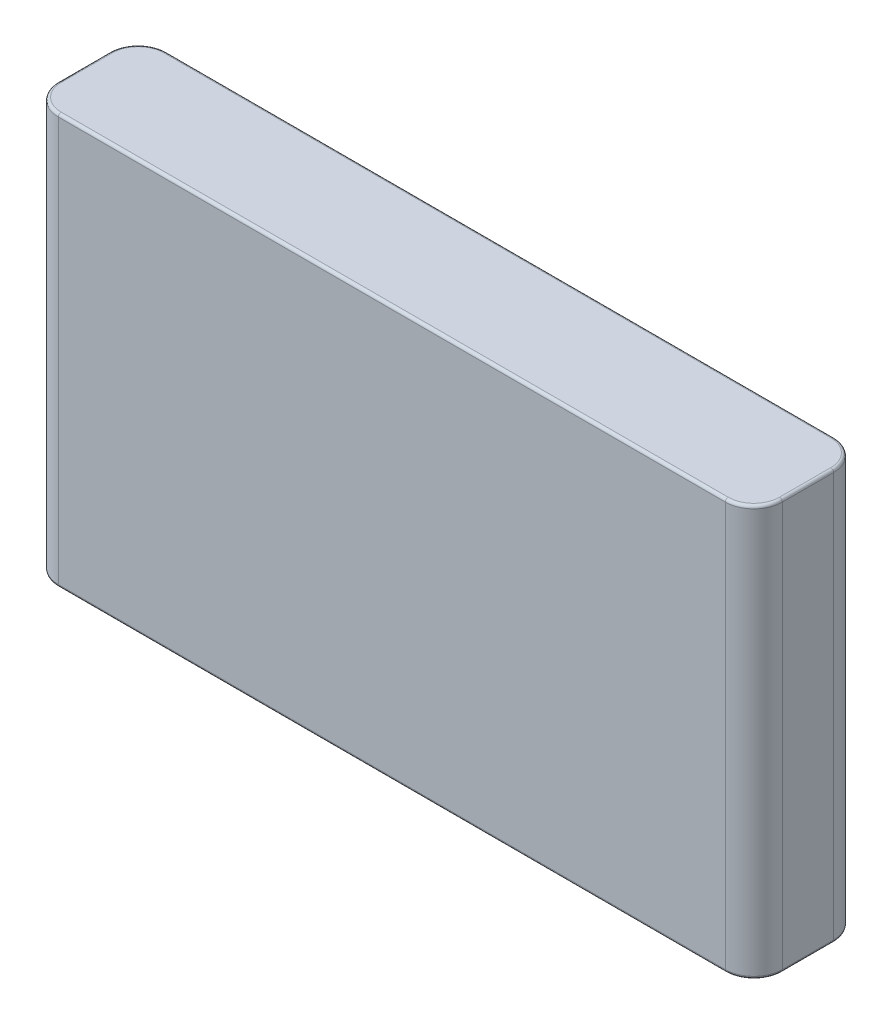
ISO-10303-21;
HEADER;
FILE_DESCRIPTION(('STEP AP214'),'2;1');
FILE_NAME('part.step','',(''),(''),'','','');
FILE_SCHEMA(('AUTOMOTIVE_DESIGN { 1 0 10303 214 1 1 1 1 }'));
ENDSEC;
DATA;
#1=APPLICATION_CONTEXT('core data for automotive mechanical design processes');
#2=APPLICATION_PROTOCOL_DEFINITION('international standard','automotive_design',2000,#1);
#3=PRODUCT_CONTEXT('',#1,'mechanical');
#4=PRODUCT('Part','Part','',(#3));
#5=PRODUCT_RELATED_PRODUCT_CATEGORY('part','',(#4));
#6=PRODUCT_DEFINITION_FORMATION('','',#4);
#7=PRODUCT_DEFINITION_CONTEXT('part definition',#1,'design');
#8=PRODUCT_DEFINITION('design','',#6,#7);
#9=PRODUCT_DEFINITION_SHAPE('','',#8);
#10=(LENGTH_UNIT() NAMED_UNIT(*) SI_UNIT(.MILLI.,.METRE.));
#11=(NAMED_UNIT(*) PLANE_ANGLE_UNIT() SI_UNIT($,.RADIAN.));
#12=(NAMED_UNIT(*) SI_UNIT($,.STERADIAN.) SOLID_ANGLE_UNIT());
#13=UNCERTAINTY_MEASURE_WITH_UNIT(LENGTH_MEASURE(1.E-05),#10,'distance_accuracy_value','');
#14=(GEOMETRIC_REPRESENTATION_CONTEXT(3) GLOBAL_UNCERTAINTY_ASSIGNED_CONTEXT((#13)) GLOBAL_UNIT_ASSIGNED_CONTEXT((#10,
#11,#12)) REPRESENTATION_CONTEXT('',''));
#15=CARTESIAN_POINT('',(0.,0.,0.));
#16=DIRECTION('',(0.,0.,1.));
#17=DIRECTION('',(1.,0.,0.));
#18=AXIS2_PLACEMENT_3D('',#15,#16,#17);
#19=CARTESIAN_POINT('',(63.5,-36.,19.));
#20=DIRECTION('',(-1.,0.,0.));
#21=DIRECTION('',(0.,0.,1.));
#22=AXIS2_PLACEMENT_3D('',#19,#20,#21);
#23=PLANE('',#22);
#24=DIRECTION('',(0.,1.,0.));
#25=VECTOR('',#24,1.);
#26=CARTESIAN_POINT('',(63.5,36.,5.));
#27=LINE('',#26,#25);
#28=CARTESIAN_POINT('',(63.5,-35.5,5.));
#29=VERTEX_POINT('',#28);
#30=CARTESIAN_POINT('',(63.5,35.5,5.));
#31=VERTEX_POINT('',#30);
#32=EDGE_CURVE('E291',#29,#31,#27,.T.);
#33=ORIENTED_EDGE('',*,*,#32,.T.);
#34=DIRECTION('',(0.,0.,-1.));
#35=VECTOR('',#34,1.);
#36=CARTESIAN_POINT('',(63.5,35.5,19.));
#37=LINE('',#36,#35);
#38=CARTESIAN_POINT('',(63.5,35.5,14.));
#39=VERTEX_POINT('',#38);
#40=EDGE_CURVE('E199',#31,#39,#37,.F.);
#41=ORIENTED_EDGE('',*,*,#40,.T.);
#42=DIRECTION('',(0.,1.,0.));
#43=VECTOR('',#42,1.);
#44=CARTESIAN_POINT('',(63.5,-36.,14.));
#45=LINE('',#44,#43);
#46=CARTESIAN_POINT('',(63.5,-35.5,14.));
#47=VERTEX_POINT('',#46);
#48=EDGE_CURVE('E252',#39,#47,#45,.F.);
#49=ORIENTED_EDGE('',*,*,#48,.T.);
#50=DIRECTION('',(0.,0.,-1.));
#51=VECTOR('',#50,1.);
#52=CARTESIAN_POINT('',(63.5,-35.5,19.));
#53=LINE('',#52,#51);
#54=EDGE_CURVE('E197',#47,#29,#53,.T.);
#55=ORIENTED_EDGE('',*,*,#54,.T.);
#56=EDGE_LOOP('',(#33,#41,#49,#55));
#57=FACE_BOUND('',#56,.T.);
#58=ADVANCED_FACE('F33',(#57),#23,.F.);
#59=CARTESIAN_POINT('',(-63.5,36.,19.));
#60=DIRECTION('',(0.,-1.,0.));
#61=DIRECTION('',(0.,0.,-1.));
#62=AXIS2_PLACEMENT_3D('',#59,#60,#61);
#63=PLANE('',#62);
#64=DIRECTION('',(-1.,0.,0.));
#65=VECTOR('',#64,1.);
#66=CARTESIAN_POINT('',(-63.5,36.,18.5));
#67=LINE('',#66,#65);
#68=CARTESIAN_POINT('',(-58.5,36.,18.5));
#69=VERTEX_POINT('',#68);
#70=CARTESIAN_POINT('',(58.5,36.,18.5));
#71=VERTEX_POINT('',#70);
#72=EDGE_CURVE('E153',#69,#71,#67,.F.);
#73=ORIENTED_EDGE('',*,*,#72,.T.);
#74=CARTESIAN_POINT('',(58.5,36.,14.));
#75=DIRECTION('',(0.,-1.,0.));
#76=DIRECTION('',(0.,0.,-1.));
#77=AXIS2_PLACEMENT_3D('',#74,#75,#76);
#78=CIRCLE('',#77,4.5);
#79=CARTESIAN_POINT('',(63.,36.,14.));
#80=VERTEX_POINT('',#79);
#81=EDGE_CURVE('E190',#71,#80,#78,.F.);
#82=ORIENTED_EDGE('',*,*,#81,.T.);
#83=DIRECTION('',(0.,0.,-1.));
#84=VECTOR('',#83,1.);
#85=CARTESIAN_POINT('',(63.,36.,19.));
#86=LINE('',#85,#84);
#87=CARTESIAN_POINT('',(63.,36.,5.));
#88=VERTEX_POINT('',#87);
#89=EDGE_CURVE('E188',#80,#88,#86,.T.);
#90=ORIENTED_EDGE('',*,*,#89,.T.);
#91=CARTESIAN_POINT('',(58.5,36.,5.));
#92=DIRECTION('',(0.,-1.,0.));
#93=DIRECTION('',(0.,0.,-1.));
#94=AXIS2_PLACEMENT_3D('',#91,#92,#93);
#95=CIRCLE('',#94,4.5);
#96=CARTESIAN_POINT('',(58.5,36.,0.5));
#97=VERTEX_POINT('',#96);
#98=EDGE_CURVE('E186',#88,#97,#95,.F.);
#99=ORIENTED_EDGE('',*,*,#98,.T.);
#100=DIRECTION('',(-1.,0.,0.));
#101=VECTOR('',#100,1.);
#102=CARTESIAN_POINT('',(-58.5,36.,0.5));
#103=LINE('',#102,#101);
#104=CARTESIAN_POINT('',(-58.5,36.,0.5));
#105=VERTEX_POINT('',#104);
#106=EDGE_CURVE('E184',#97,#105,#103,.T.);
#107=ORIENTED_EDGE('',*,*,#106,.T.);
#108=CARTESIAN_POINT('',(-58.5,36.,5.));
#109=DIRECTION('',(0.,-1.,0.));
#110=DIRECTION('',(0.,0.,-1.));
#111=AXIS2_PLACEMENT_3D('',#108,#109,#110);
#112=CIRCLE('',#111,4.5);
#113=CARTESIAN_POINT('',(-63.,36.,5.));
#114=VERTEX_POINT('',#113);
#115=EDGE_CURVE('E182',#105,#114,#112,.F.);
#116=ORIENTED_EDGE('',*,*,#115,.T.);
#117=DIRECTION('',(0.,0.,-1.));
#118=VECTOR('',#117,1.);
#119=CARTESIAN_POINT('',(-63.,36.,19.));
#120=LINE('',#119,#118);
#121=CARTESIAN_POINT('',(-63.,36.,14.));
#122=VERTEX_POINT('',#121);
#123=EDGE_CURVE('E156',#114,#122,#120,.F.);
#124=ORIENTED_EDGE('',*,*,#123,.T.);
#125=CARTESIAN_POINT('',(-58.5,36.,14.));
#126=DIRECTION('',(0.,-1.,0.));
#127=DIRECTION('',(0.,0.,-1.));
#128=AXIS2_PLACEMENT_3D('',#125,#126,#127);
#129=CIRCLE('',#128,4.5);
#130=EDGE_CURVE('E148',#122,#69,#129,.F.);
#131=ORIENTED_EDGE('',*,*,#130,.T.);
#132=EDGE_LOOP('',(#73,#82,#90,#99,#107,#116,#124,#131));
#133=FACE_BOUND('',#132,.T.);
#134=ADVANCED_FACE('F150',(#133),#63,.F.);
#135=CARTESIAN_POINT('',(-63.5,-36.,19.));
#136=DIRECTION('',(1.,0.,0.));
#137=DIRECTION('',(0.,0.,-1.));
#138=AXIS2_PLACEMENT_3D('',#135,#136,#137);
#139=PLANE('',#138);
#140=DIRECTION('',(0.,-1.,0.));
#141=VECTOR('',#140,1.);
#142=CARTESIAN_POINT('',(-63.5,-36.,14.));
#143=LINE('',#142,#141);
#144=CARTESIAN_POINT('',(-63.5,-35.5,14.));
#145=VERTEX_POINT('',#144);
#146=CARTESIAN_POINT('',(-63.5,35.5,14.));
#147=VERTEX_POINT('',#146);
#148=EDGE_CURVE('E177',#145,#147,#143,.F.);
#149=ORIENTED_EDGE('',*,*,#148,.T.);
#150=DIRECTION('',(0.,0.,-1.));
#151=VECTOR('',#150,1.);
#152=CARTESIAN_POINT('',(-63.5,35.5,19.));
#153=LINE('',#152,#151);
#154=CARTESIAN_POINT('',(-63.5,35.5,5.));
#155=VERTEX_POINT('',#154);
#156=EDGE_CURVE('E215',#147,#155,#153,.T.);
#157=ORIENTED_EDGE('',*,*,#156,.T.);
#158=DIRECTION('',(0.,-1.,0.));
#159=VECTOR('',#158,1.);
#160=CARTESIAN_POINT('',(-63.5,-36.,5.));
#161=LINE('',#160,#159);
#162=CARTESIAN_POINT('',(-63.5,-35.5,5.));
#163=VERTEX_POINT('',#162);
#164=EDGE_CURVE('E174',#155,#163,#161,.T.);
#165=ORIENTED_EDGE('',*,*,#164,.T.);
#166=DIRECTION('',(0.,0.,-1.));
#167=VECTOR('',#166,1.);
#168=CARTESIAN_POINT('',(-63.5,-35.5,19.));
#169=LINE('',#168,#167);
#170=EDGE_CURVE('E213',#163,#145,#169,.F.);
#171=ORIENTED_EDGE('',*,*,#170,.T.);
#172=EDGE_LOOP('',(#149,#157,#165,#171));
#173=FACE_BOUND('',#172,.T.);
#174=ADVANCED_FACE('F311',(#173),#139,.F.);
#175=CARTESIAN_POINT('',(-63.5,-36.,19.));
#176=DIRECTION('',(0.,1.,0.));
#177=DIRECTION('',(0.,0.,1.));
#178=AXIS2_PLACEMENT_3D('',#175,#176,#177);
#179=PLANE('',#178);
#180=DIRECTION('',(1.,0.,0.));
#181=VECTOR('',#180,1.);
#182=CARTESIAN_POINT('',(-63.5,-36.,18.5));
#183=LINE('',#182,#181);
#184=CARTESIAN_POINT('',(58.5,-36.,18.5));
#185=VERTEX_POINT('',#184);
#186=CARTESIAN_POINT('',(-58.5,-36.,18.5));
#187=VERTEX_POINT('',#186);
#188=EDGE_CURVE('E221',#185,#187,#183,.F.);
#189=ORIENTED_EDGE('',*,*,#188,.T.);
#190=CARTESIAN_POINT('',(-58.5,-36.,14.));
#191=DIRECTION('',(0.,1.,0.));
#192=DIRECTION('',(0.,0.,1.));
#193=AXIS2_PLACEMENT_3D('',#190,#191,#192);
#194=CIRCLE('',#193,4.5);
#195=CARTESIAN_POINT('',(-63.,-36.,14.));
#196=VERTEX_POINT('',#195);
#197=EDGE_CURVE('E234',#187,#196,#194,.F.);
#198=ORIENTED_EDGE('',*,*,#197,.T.);
#199=DIRECTION('',(0.,0.,-1.));
#200=VECTOR('',#199,1.);
#201=CARTESIAN_POINT('',(-63.,-36.,19.));
#202=LINE('',#201,#200);
#203=CARTESIAN_POINT('',(-63.,-36.,5.));
#204=VERTEX_POINT('',#203);
#205=EDGE_CURVE('E57',#196,#204,#202,.T.);
#206=ORIENTED_EDGE('',*,*,#205,.T.);
#207=CARTESIAN_POINT('',(-58.5,-36.,5.));
#208=DIRECTION('',(0.,1.,0.));
#209=DIRECTION('',(0.,0.,1.));
#210=AXIS2_PLACEMENT_3D('',#207,#208,#209);
#211=CIRCLE('',#210,4.5);
#212=CARTESIAN_POINT('',(-58.5,-36.,0.5));
#213=VERTEX_POINT('',#212);
#214=EDGE_CURVE('E231',#204,#213,#211,.F.);
#215=ORIENTED_EDGE('',*,*,#214,.T.);
#216=DIRECTION('',(1.,0.,0.));
#217=VECTOR('',#216,1.);
#218=CARTESIAN_POINT('',(58.5,-36.,0.5));
#219=LINE('',#218,#217);
#220=CARTESIAN_POINT('',(58.5,-36.,0.5));
#221=VERTEX_POINT('',#220);
#222=EDGE_CURVE('E229',#213,#221,#219,.T.);
#223=ORIENTED_EDGE('',*,*,#222,.T.);
#224=CARTESIAN_POINT('',(58.5,-36.,5.));
#225=DIRECTION('',(0.,1.,0.));
#226=DIRECTION('',(0.,0.,1.));
#227=AXIS2_PLACEMENT_3D('',#224,#225,#226);
#228=CIRCLE('',#227,4.5);
#229=CARTESIAN_POINT('',(63.,-36.,5.));
#230=VERTEX_POINT('',#229);
#231=EDGE_CURVE('E227',#221,#230,#228,.F.);
#232=ORIENTED_EDGE('',*,*,#231,.T.);
#233=DIRECTION('',(0.,0.,-1.));
#234=VECTOR('',#233,1.);
#235=CARTESIAN_POINT('',(63.,-36.,19.));
#236=LINE('',#235,#234);
#237=CARTESIAN_POINT('',(63.,-36.,14.));
#238=VERTEX_POINT('',#237);
#239=EDGE_CURVE('E225',#230,#238,#236,.F.);
#240=ORIENTED_EDGE('',*,*,#239,.T.);
#241=CARTESIAN_POINT('',(58.5,-36.,14.));
#242=DIRECTION('',(0.,1.,0.));
#243=DIRECTION('',(0.,0.,1.));
#244=AXIS2_PLACEMENT_3D('',#241,#242,#243);
#245=CIRCLE('',#244,4.5);
#246=EDGE_CURVE('E223',#238,#185,#245,.F.);
#247=ORIENTED_EDGE('',*,*,#246,.T.);
#248=EDGE_LOOP('',(#189,#198,#206,#215,#223,#232,#240,#247));
#249=FACE_BOUND('',#248,.T.);
#250=ADVANCED_FACE('F332',(#249),#179,.F.);
#251=CARTESIAN_POINT('',(0.,0.,19.));
#252=DIRECTION('',(0.,0.,-1.));
#253=DIRECTION('',(-1.,0.,0.));
#254=AXIS2_PLACEMENT_3D('',#251,#252,#253);
#255=PLANE('',#254);
#256=DIRECTION('',(0.,1.,0.));
#257=VECTOR('',#256,1.);
#258=CARTESIAN_POINT('',(58.5,0.,19.));
#259=LINE('',#258,#257);
#260=CARTESIAN_POINT('',(58.5,-35.5,19.));
#261=VERTEX_POINT('',#260);
#262=CARTESIAN_POINT('',(58.5,35.5,19.));
#263=VERTEX_POINT('',#262);
#264=EDGE_CURVE('E301',#261,#263,#259,.T.);
#265=ORIENTED_EDGE('',*,*,#264,.T.);
#266=DIRECTION('',(-1.,0.,0.));
#267=VECTOR('',#266,1.);
#268=CARTESIAN_POINT('',(0.,35.5,19.));
#269=LINE('',#268,#267);
#270=CARTESIAN_POINT('',(-58.5,35.5,19.));
#271=VERTEX_POINT('',#270);
#272=EDGE_CURVE('E11',#263,#271,#269,.T.);
#273=ORIENTED_EDGE('',*,*,#272,.T.);
#274=DIRECTION('',(0.,-1.,0.));
#275=VECTOR('',#274,1.);
#276=CARTESIAN_POINT('',(-58.5,0.,19.));
#277=LINE('',#276,#275);
#278=CARTESIAN_POINT('',(-58.5,-35.5,19.));
#279=VERTEX_POINT('',#278);
#280=EDGE_CURVE('E297',#271,#279,#277,.T.);
#281=ORIENTED_EDGE('',*,*,#280,.T.);
#282=DIRECTION('',(1.,0.,0.));
#283=VECTOR('',#282,1.);
#284=CARTESIAN_POINT('',(0.,-35.5,19.));
#285=LINE('',#284,#283);
#286=EDGE_CURVE('E42',#279,#261,#285,.T.);
#287=ORIENTED_EDGE('',*,*,#286,.T.);
#288=EDGE_LOOP('',(#265,#273,#281,#287));
#289=FACE_BOUND('',#288,.T.);
#290=ADVANCED_FACE('F344',(#289),#255,.F.);
#291=CARTESIAN_POINT('',(0.,0.,0.));
#292=DIRECTION('',(0.,0.,-1.));
#293=DIRECTION('',(-1.,0.,0.));
#294=AXIS2_PLACEMENT_3D('',#291,#292,#293);
#295=PLANE('',#294);
#296=DIRECTION('',(0.,-1.,0.));
#297=VECTOR('',#296,1.);
#298=CARTESIAN_POINT('',(-58.5,36.,0.));
#299=LINE('',#298,#297);
#300=CARTESIAN_POINT('',(-58.5,-35.5,0.));
#301=VERTEX_POINT('',#300);
#302=CARTESIAN_POINT('',(-58.5,35.5,0.));
#303=VERTEX_POINT('',#302);
#304=EDGE_CURVE('E298',#301,#303,#299,.F.);
#305=ORIENTED_EDGE('',*,*,#304,.T.);
#306=DIRECTION('',(-1.,0.,0.));
#307=VECTOR('',#306,1.);
#308=CARTESIAN_POINT('',(58.5,35.5,0.));
#309=LINE('',#308,#307);
#310=CARTESIAN_POINT('',(58.5,35.5,0.));
#311=VERTEX_POINT('',#310);
#312=EDGE_CURVE('E207',#303,#311,#309,.F.);
#313=ORIENTED_EDGE('',*,*,#312,.T.);
#314=DIRECTION('',(0.,1.,0.));
#315=VECTOR('',#314,1.);
#316=CARTESIAN_POINT('',(58.5,-36.,0.));
#317=LINE('',#316,#315);
#318=CARTESIAN_POINT('',(58.5,-35.5,0.));
#319=VERTEX_POINT('',#318);
#320=EDGE_CURVE('E288',#311,#319,#317,.F.);
#321=ORIENTED_EDGE('',*,*,#320,.T.);
#322=DIRECTION('',(1.,0.,0.));
#323=VECTOR('',#322,1.);
#324=CARTESIAN_POINT('',(-58.5,-35.5,0.));
#325=LINE('',#324,#323);
#326=EDGE_CURVE('E205',#319,#301,#325,.F.);
#327=ORIENTED_EDGE('',*,*,#326,.T.);
#328=EDGE_LOOP('',(#305,#313,#321,#327));
#329=FACE_BOUND('',#328,.T.);
#330=ADVANCED_FACE('F294',(#329),#295,.T.);
#331=CARTESIAN_POINT('',(58.5,-36.,5.));
#332=DIRECTION('',(0.,-1.,0.));
#333=DIRECTION('',(0.,0.,-1.));
#334=AXIS2_PLACEMENT_3D('',#331,#332,#333);
#335=CYLINDRICAL_SURFACE('',#334,5.);
#336=ORIENTED_EDGE('',*,*,#320,.F.);
#337=CARTESIAN_POINT('',(58.5,35.5,5.));
#338=DIRECTION('',(0.,-1.,0.));
#339=DIRECTION('',(0.,0.,-1.));
#340=AXIS2_PLACEMENT_3D('',#337,#338,#339);
#341=CIRCLE('',#340,5.);
#342=EDGE_CURVE('E203',#311,#31,#341,.T.);
#343=ORIENTED_EDGE('',*,*,#342,.T.);
#344=ORIENTED_EDGE('',*,*,#32,.F.);
#345=CARTESIAN_POINT('',(58.5,-35.5,5.));
#346=DIRECTION('',(0.,1.,0.));
#347=DIRECTION('',(0.,0.,1.));
#348=AXIS2_PLACEMENT_3D('',#345,#346,#347);
#349=CIRCLE('',#348,5.);
#350=EDGE_CURVE('E201',#29,#319,#349,.T.);
#351=ORIENTED_EDGE('',*,*,#350,.T.);
#352=EDGE_LOOP('',(#336,#343,#344,#351));
#353=FACE_BOUND('',#352,.T.);
#354=ADVANCED_FACE('F287',(#353),#335,.T.);
#355=CARTESIAN_POINT('',(58.5,0.,14.));
#356=DIRECTION('',(0.,1.,0.));
#357=DIRECTION('',(0.,0.,1.));
#358=AXIS2_PLACEMENT_3D('',#355,#356,#357);
#359=CYLINDRICAL_SURFACE('',#358,5.);
#360=ORIENTED_EDGE('',*,*,#48,.F.);
#361=CARTESIAN_POINT('',(58.5,35.5,14.));
#362=DIRECTION('',(0.,-1.,0.));
#363=DIRECTION('',(0.,0.,-1.));
#364=AXIS2_PLACEMENT_3D('',#361,#362,#363);
#365=CIRCLE('',#364,5.);
#366=EDGE_CURVE('E194',#39,#263,#365,.T.);
#367=ORIENTED_EDGE('',*,*,#366,.T.);
#368=ORIENTED_EDGE('',*,*,#264,.F.);
#369=CARTESIAN_POINT('',(58.5,-35.5,14.));
#370=DIRECTION('',(0.,1.,0.));
#371=DIRECTION('',(0.,0.,1.));
#372=AXIS2_PLACEMENT_3D('',#369,#370,#371);
#373=CIRCLE('',#372,5.);
#374=EDGE_CURVE('E192',#261,#47,#373,.T.);
#375=ORIENTED_EDGE('',*,*,#374,.T.);
#376=EDGE_LOOP('',(#360,#367,#368,#375));
#377=FACE_BOUND('',#376,.T.);
#378=ADVANCED_FACE('F348',(#377),#359,.T.);
#379=CARTESIAN_POINT('',(-58.5,-36.,5.));
#380=DIRECTION('',(0.,1.,0.));
#381=DIRECTION('',(0.,0.,1.));
#382=AXIS2_PLACEMENT_3D('',#379,#380,#381);
#383=CYLINDRICAL_SURFACE('',#382,5.);
#384=ORIENTED_EDGE('',*,*,#164,.F.);
#385=CARTESIAN_POINT('',(-58.5,35.5,5.));
#386=DIRECTION('',(0.,-1.,0.));
#387=DIRECTION('',(0.,0.,-1.));
#388=AXIS2_PLACEMENT_3D('',#385,#386,#387);
#389=CIRCLE('',#388,5.);
#390=EDGE_CURVE('E211',#155,#303,#389,.T.);
#391=ORIENTED_EDGE('',*,*,#390,.T.);
#392=ORIENTED_EDGE('',*,*,#304,.F.);
#393=CARTESIAN_POINT('',(-58.5,-35.5,5.));
#394=DIRECTION('',(0.,1.,0.));
#395=DIRECTION('',(0.,0.,1.));
#396=AXIS2_PLACEMENT_3D('',#393,#394,#395);
#397=CIRCLE('',#396,5.);
#398=EDGE_CURVE('E209',#301,#163,#397,.T.);
#399=ORIENTED_EDGE('',*,*,#398,.T.);
#400=EDGE_LOOP('',(#384,#391,#392,#399));
#401=FACE_BOUND('',#400,.T.);
#402=ADVANCED_FACE('F324',(#401),#383,.T.);
#403=CARTESIAN_POINT('',(-58.5,0.,14.));
#404=DIRECTION('',(0.,-1.,0.));
#405=DIRECTION('',(0.,0.,-1.));
#406=AXIS2_PLACEMENT_3D('',#403,#404,#405);
#407=CYLINDRICAL_SURFACE('',#406,5.);
#408=ORIENTED_EDGE('',*,*,#280,.F.);
#409=CARTESIAN_POINT('',(-58.5,35.5,14.));
#410=DIRECTION('',(0.,-1.,0.));
#411=DIRECTION('',(0.,0.,-1.));
#412=AXIS2_PLACEMENT_3D('',#409,#410,#411);
#413=CIRCLE('',#412,5.);
#414=EDGE_CURVE('E165',#271,#147,#413,.T.);
#415=ORIENTED_EDGE('',*,*,#414,.T.);
#416=ORIENTED_EDGE('',*,*,#148,.F.);
#417=CARTESIAN_POINT('',(-58.5,-35.5,14.));
#418=DIRECTION('',(0.,1.,0.));
#419=DIRECTION('',(0.,0.,1.));
#420=AXIS2_PLACEMENT_3D('',#417,#418,#419);
#421=CIRCLE('',#420,5.);
#422=EDGE_CURVE('E217',#145,#279,#421,.T.);
#423=ORIENTED_EDGE('',*,*,#422,.T.);
#424=EDGE_LOOP('',(#408,#415,#416,#423));
#425=FACE_BOUND('',#424,.T.);
#426=ADVANCED_FACE('F343',(#425),#407,.T.);
#427=CARTESIAN_POINT('',(-58.5,35.5,5.));
#428=DIRECTION('',(0.,-1.,0.));
#429=DIRECTION('',(0.,0.,-1.));
#430=AXIS2_PLACEMENT_3D('',#427,#428,#429);
#431=TOROIDAL_SURFACE('',#430,4.5,0.5);
#432=CARTESIAN_POINT('',(-58.5,35.5,0.500000000000001));
#433=DIRECTION('',(1.,0.,0.));
#434=DIRECTION('',(0.,0.,-1.));
#435=AXIS2_PLACEMENT_3D('',#432,#433,#434);
#436=CIRCLE('',#435,0.5);
#437=EDGE_CURVE('E246',#303,#105,#436,.T.);
#438=ORIENTED_EDGE('',*,*,#437,.F.);
#439=ORIENTED_EDGE('',*,*,#390,.F.);
#440=CARTESIAN_POINT('',(-63.,35.5,5.));
#441=DIRECTION('',(0.,0.,1.));
#442=DIRECTION('',(1.,0.,0.));
#443=AXIS2_PLACEMENT_3D('',#440,#441,#442);
#444=CIRCLE('',#443,0.5);
#445=EDGE_CURVE('E249',#114,#155,#444,.T.);
#446=ORIENTED_EDGE('',*,*,#445,.F.);
#447=ORIENTED_EDGE('',*,*,#115,.F.);
#448=EDGE_LOOP('',(#438,#439,#446,#447));
#449=FACE_BOUND('',#448,.T.);
#450=ADVANCED_FACE('F322',(#449),#431,.T.);
#451=CARTESIAN_POINT('',(-63.,35.5,19.));
#452=DIRECTION('',(0.,0.,-1.));
#453=DIRECTION('',(-1.,0.,0.));
#454=AXIS2_PLACEMENT_3D('',#451,#452,#453);
#455=CYLINDRICAL_SURFACE('',#454,0.5);
#456=ORIENTED_EDGE('',*,*,#445,.T.);
#457=ORIENTED_EDGE('',*,*,#156,.F.);
#458=CARTESIAN_POINT('',(-63.,35.5,14.));
#459=DIRECTION('',(0.,0.,1.));
#460=DIRECTION('',(1.,0.,0.));
#461=AXIS2_PLACEMENT_3D('',#458,#459,#460);
#462=CIRCLE('',#461,0.5);
#463=EDGE_CURVE('E244',#122,#147,#462,.T.);
#464=ORIENTED_EDGE('',*,*,#463,.F.);
#465=ORIENTED_EDGE('',*,*,#123,.F.);
#466=EDGE_LOOP('',(#456,#457,#464,#465));
#467=FACE_BOUND('',#466,.T.);
#468=ADVANCED_FACE('F316',(#467),#455,.T.);
#469=CARTESIAN_POINT('',(-63.5,35.5,0.5));
#470=DIRECTION('',(1.,0.,0.));
#471=DIRECTION('',(0.,0.,-1.));
#472=AXIS2_PLACEMENT_3D('',#469,#470,#471);
#473=CYLINDRICAL_SURFACE('',#472,0.5);
#474=ORIENTED_EDGE('',*,*,#437,.T.);
#475=ORIENTED_EDGE('',*,*,#106,.F.);
#476=CARTESIAN_POINT('',(58.5,35.5,0.5));
#477=DIRECTION('',(1.,0.,0.));
#478=DIRECTION('',(0.,0.,-1.));
#479=AXIS2_PLACEMENT_3D('',#476,#477,#478);
#480=CIRCLE('',#479,0.5);
#481=EDGE_CURVE('E168',#311,#97,#480,.T.);
#482=ORIENTED_EDGE('',*,*,#481,.F.);
#483=ORIENTED_EDGE('',*,*,#312,.F.);
#484=EDGE_LOOP('',(#474,#475,#482,#483));
#485=FACE_BOUND('',#484,.T.);
#486=ADVANCED_FACE('F365',(#485),#473,.T.);
#487=CARTESIAN_POINT('',(-58.5,35.5,14.));
#488=DIRECTION('',(0.,-1.,0.));
#489=DIRECTION('',(0.,0.,-1.));
#490=AXIS2_PLACEMENT_3D('',#487,#488,#489);
#491=TOROIDAL_SURFACE('',#490,4.5,0.5);
#492=ORIENTED_EDGE('',*,*,#463,.T.);
#493=ORIENTED_EDGE('',*,*,#414,.F.);
#494=CARTESIAN_POINT('',(-58.5,35.5,18.5));
#495=DIRECTION('',(1.,0.,0.));
#496=DIRECTION('',(0.,0.,-1.));
#497=AXIS2_PLACEMENT_3D('',#494,#495,#496);
#498=CIRCLE('',#497,0.5);
#499=EDGE_CURVE('E163',#69,#271,#498,.T.);
#500=ORIENTED_EDGE('',*,*,#499,.F.);
#501=ORIENTED_EDGE('',*,*,#130,.F.);
#502=EDGE_LOOP('',(#492,#493,#500,#501));
#503=FACE_BOUND('',#502,.T.);
#504=ADVANCED_FACE('F164',(#503),#491,.T.);
#505=CARTESIAN_POINT('',(58.5,35.5,5.));
#506=DIRECTION('',(0.,-1.,0.));
#507=DIRECTION('',(0.,0.,-1.));
#508=AXIS2_PLACEMENT_3D('',#505,#506,#507);
#509=TOROIDAL_SURFACE('',#508,4.5,0.5);
#510=ORIENTED_EDGE('',*,*,#481,.T.);
#511=ORIENTED_EDGE('',*,*,#98,.F.);
#512=CARTESIAN_POINT('',(63.,35.5,5.));
#513=DIRECTION('',(0.,0.,1.));
#514=DIRECTION('',(1.,0.,0.));
#515=AXIS2_PLACEMENT_3D('',#512,#513,#514);
#516=CIRCLE('',#515,0.5);
#517=EDGE_CURVE('E169',#31,#88,#516,.T.);
#518=ORIENTED_EDGE('',*,*,#517,.F.);
#519=ORIENTED_EDGE('',*,*,#342,.F.);
#520=EDGE_LOOP('',(#510,#511,#518,#519));
#521=FACE_BOUND('',#520,.T.);
#522=ADVANCED_FACE('F362',(#521),#509,.T.);
#523=CARTESIAN_POINT('',(0.,35.5,18.5));
#524=DIRECTION('',(-1.,0.,0.));
#525=DIRECTION('',(0.,0.,1.));
#526=AXIS2_PLACEMENT_3D('',#523,#524,#525);
#527=CYLINDRICAL_SURFACE('',#526,0.5);
#528=ORIENTED_EDGE('',*,*,#499,.T.);
#529=ORIENTED_EDGE('',*,*,#272,.F.);
#530=CARTESIAN_POINT('',(58.5,35.5,18.5));
#531=DIRECTION('',(1.,0.,0.));
#532=DIRECTION('',(0.,0.,-1.));
#533=AXIS2_PLACEMENT_3D('',#530,#531,#532);
#534=CIRCLE('',#533,0.5);
#535=EDGE_CURVE('E172',#71,#263,#534,.T.);
#536=ORIENTED_EDGE('',*,*,#535,.F.);
#537=ORIENTED_EDGE('',*,*,#72,.F.);
#538=EDGE_LOOP('',(#528,#529,#536,#537));
#539=FACE_BOUND('',#538,.T.);
#540=ADVANCED_FACE('F171',(#539),#527,.T.);
#541=CARTESIAN_POINT('',(63.,35.5,19.));
#542=DIRECTION('',(0.,0.,-1.));
#543=DIRECTION('',(-1.,0.,0.));
#544=AXIS2_PLACEMENT_3D('',#541,#542,#543);
#545=CYLINDRICAL_SURFACE('',#544,0.5);
#546=ORIENTED_EDGE('',*,*,#517,.T.);
#547=ORIENTED_EDGE('',*,*,#89,.F.);
#548=CARTESIAN_POINT('',(63.,35.5,14.));
#549=DIRECTION('',(0.,0.,1.));
#550=DIRECTION('',(1.,0.,0.));
#551=AXIS2_PLACEMENT_3D('',#548,#549,#550);
#552=CIRCLE('',#551,0.5);
#553=EDGE_CURVE('E237',#39,#80,#552,.T.);
#554=ORIENTED_EDGE('',*,*,#553,.F.);
#555=ORIENTED_EDGE('',*,*,#40,.F.);
#556=EDGE_LOOP('',(#546,#547,#554,#555));
#557=FACE_BOUND('',#556,.T.);
#558=ADVANCED_FACE('F357',(#557),#545,.T.);
#559=CARTESIAN_POINT('',(58.5,35.5,14.));
#560=DIRECTION('',(0.,-1.,0.));
#561=DIRECTION('',(0.,0.,-1.));
#562=AXIS2_PLACEMENT_3D('',#559,#560,#561);
#563=TOROIDAL_SURFACE('',#562,4.5,0.5);
#564=ORIENTED_EDGE('',*,*,#535,.T.);
#565=ORIENTED_EDGE('',*,*,#366,.F.);
#566=ORIENTED_EDGE('',*,*,#553,.T.);
#567=ORIENTED_EDGE('',*,*,#81,.F.);
#568=EDGE_LOOP('',(#564,#565,#566,#567));
#569=FACE_BOUND('',#568,.T.);
#570=ADVANCED_FACE('F353',(#569),#563,.T.);
#571=CARTESIAN_POINT('',(58.5,-35.5,5.));
#572=DIRECTION('',(0.,1.,0.));
#573=DIRECTION('',(0.,0.,1.));
#574=AXIS2_PLACEMENT_3D('',#571,#572,#573);
#575=TOROIDAL_SURFACE('',#574,4.5,0.5);
#576=CARTESIAN_POINT('',(58.5,-35.5,0.500000000000001));
#577=DIRECTION('',(-1.,0.,0.));
#578=DIRECTION('',(0.,0.,1.));
#579=AXIS2_PLACEMENT_3D('',#576,#577,#578);
#580=CIRCLE('',#579,0.5);
#581=EDGE_CURVE('E267',#319,#221,#580,.T.);
#582=ORIENTED_EDGE('',*,*,#581,.F.);
#583=ORIENTED_EDGE('',*,*,#350,.F.);
#584=CARTESIAN_POINT('',(63.,-35.5,5.));
#585=DIRECTION('',(0.,0.,1.));
#586=DIRECTION('',(1.,0.,0.));
#587=AXIS2_PLACEMENT_3D('',#584,#585,#586);
#588=CIRCLE('',#587,0.5);
#589=EDGE_CURVE('E37',#230,#29,#588,.T.);
#590=ORIENTED_EDGE('',*,*,#589,.F.);
#591=ORIENTED_EDGE('',*,*,#231,.F.);
#592=EDGE_LOOP('',(#582,#583,#590,#591));
#593=FACE_BOUND('',#592,.T.);
#594=ADVANCED_FACE('F35',(#593),#575,.T.);
#595=CARTESIAN_POINT('',(63.,-35.5,19.));
#596=DIRECTION('',(0.,0.,-1.));
#597=DIRECTION('',(-1.,0.,0.));
#598=AXIS2_PLACEMENT_3D('',#595,#596,#597);
#599=CYLINDRICAL_SURFACE('',#598,0.5);
#600=ORIENTED_EDGE('',*,*,#589,.T.);
#601=ORIENTED_EDGE('',*,*,#54,.F.);
#602=CARTESIAN_POINT('',(63.,-35.5,14.));
#603=DIRECTION('',(0.,0.,1.));
#604=DIRECTION('',(1.,0.,0.));
#605=AXIS2_PLACEMENT_3D('',#602,#603,#604);
#606=CIRCLE('',#605,0.5);
#607=EDGE_CURVE('E265',#238,#47,#606,.T.);
#608=ORIENTED_EDGE('',*,*,#607,.F.);
#609=ORIENTED_EDGE('',*,*,#239,.F.);
#610=EDGE_LOOP('',(#600,#601,#608,#609));
#611=FACE_BOUND('',#610,.T.);
#612=ADVANCED_FACE('F278',(#611),#599,.T.);
#613=CARTESIAN_POINT('',(-63.5,-35.5,0.5));
#614=DIRECTION('',(-1.,0.,0.));
#615=DIRECTION('',(0.,0.,1.));
#616=AXIS2_PLACEMENT_3D('',#613,#614,#615);
#617=CYLINDRICAL_SURFACE('',#616,0.5);
#618=ORIENTED_EDGE('',*,*,#581,.T.);
#619=ORIENTED_EDGE('',*,*,#222,.F.);
#620=CARTESIAN_POINT('',(-58.5,-35.5,0.5));
#621=DIRECTION('',(-1.,0.,0.));
#622=DIRECTION('',(0.,0.,1.));
#623=AXIS2_PLACEMENT_3D('',#620,#621,#622);
#624=CIRCLE('',#623,0.5);
#625=EDGE_CURVE('E262',#301,#213,#624,.T.);
#626=ORIENTED_EDGE('',*,*,#625,.F.);
#627=ORIENTED_EDGE('',*,*,#326,.F.);
#628=EDGE_LOOP('',(#618,#619,#626,#627));
#629=FACE_BOUND('',#628,.T.);
#630=ADVANCED_FACE('F425',(#629),#617,.T.);
#631=CARTESIAN_POINT('',(58.5,-35.5,14.));
#632=DIRECTION('',(0.,1.,0.));
#633=DIRECTION('',(0.,0.,1.));
#634=AXIS2_PLACEMENT_3D('',#631,#632,#633);
#635=TOROIDAL_SURFACE('',#634,4.5,0.5);
#636=ORIENTED_EDGE('',*,*,#607,.T.);
#637=ORIENTED_EDGE('',*,*,#374,.F.);
#638=CARTESIAN_POINT('',(58.5,-35.5,18.5));
#639=DIRECTION('',(-1.,0.,0.));
#640=DIRECTION('',(0.,0.,1.));
#641=AXIS2_PLACEMENT_3D('',#638,#639,#640);
#642=CIRCLE('',#641,0.5);
#643=EDGE_CURVE('E259',#185,#261,#642,.T.);
#644=ORIENTED_EDGE('',*,*,#643,.F.);
#645=ORIENTED_EDGE('',*,*,#246,.F.);
#646=EDGE_LOOP('',(#636,#637,#644,#645));
#647=FACE_BOUND('',#646,.T.);
#648=ADVANCED_FACE('F431',(#647),#635,.T.);
#649=CARTESIAN_POINT('',(-58.5,-35.5,5.));
#650=DIRECTION('',(0.,1.,0.));
#651=DIRECTION('',(0.,0.,1.));
#652=AXIS2_PLACEMENT_3D('',#649,#650,#651);
#653=TOROIDAL_SURFACE('',#652,4.5,0.5);
#654=ORIENTED_EDGE('',*,*,#625,.T.);
#655=ORIENTED_EDGE('',*,*,#214,.F.);
#656=CARTESIAN_POINT('',(-63.,-35.5,5.));
#657=DIRECTION('',(0.,0.,1.));
#658=DIRECTION('',(1.,0.,0.));
#659=AXIS2_PLACEMENT_3D('',#656,#657,#658);
#660=CIRCLE('',#659,0.5);
#661=EDGE_CURVE('E256',#163,#204,#660,.T.);
#662=ORIENTED_EDGE('',*,*,#661,.F.);
#663=ORIENTED_EDGE('',*,*,#398,.F.);
#664=EDGE_LOOP('',(#654,#655,#662,#663));
#665=FACE_BOUND('',#664,.T.);
#666=ADVANCED_FACE('F329',(#665),#653,.T.);
#667=CARTESIAN_POINT('',(0.,-35.5,18.5));
#668=DIRECTION('',(1.,0.,0.));
#669=DIRECTION('',(0.,0.,-1.));
#670=AXIS2_PLACEMENT_3D('',#667,#668,#669);
#671=CYLINDRICAL_SURFACE('',#670,0.5);
#672=ORIENTED_EDGE('',*,*,#643,.T.);
#673=ORIENTED_EDGE('',*,*,#286,.F.);
#674=CARTESIAN_POINT('',(-58.5,-35.5,18.5));
#675=DIRECTION('',(-1.,0.,0.));
#676=DIRECTION('',(0.,0.,1.));
#677=AXIS2_PLACEMENT_3D('',#674,#675,#676);
#678=CIRCLE('',#677,0.5);
#679=EDGE_CURVE('E254',#187,#279,#678,.T.);
#680=ORIENTED_EDGE('',*,*,#679,.F.);
#681=ORIENTED_EDGE('',*,*,#188,.F.);
#682=EDGE_LOOP('',(#672,#673,#680,#681));
#683=FACE_BOUND('',#682,.T.);
#684=ADVANCED_FACE('F338',(#683),#671,.T.);
#685=CARTESIAN_POINT('',(-63.,-35.5,19.));
#686=DIRECTION('',(0.,0.,-1.));
#687=DIRECTION('',(-1.,0.,0.));
#688=AXIS2_PLACEMENT_3D('',#685,#686,#687);
#689=CYLINDRICAL_SURFACE('',#688,0.5);
#690=ORIENTED_EDGE('',*,*,#661,.T.);
#691=ORIENTED_EDGE('',*,*,#205,.F.);
#692=CARTESIAN_POINT('',(-63.,-35.5,14.));
#693=DIRECTION('',(0.,0.,1.));
#694=DIRECTION('',(1.,0.,0.));
#695=AXIS2_PLACEMENT_3D('',#692,#693,#694);
#696=CIRCLE('',#695,0.5);
#697=EDGE_CURVE('E50',#145,#196,#696,.T.);
#698=ORIENTED_EDGE('',*,*,#697,.F.);
#699=ORIENTED_EDGE('',*,*,#170,.F.);
#700=EDGE_LOOP('',(#690,#691,#698,#699));
#701=FACE_BOUND('',#700,.T.);
#702=ADVANCED_FACE('F331',(#701),#689,.T.);
#703=CARTESIAN_POINT('',(-58.5,-35.5,14.));
#704=DIRECTION('',(0.,1.,0.));
#705=DIRECTION('',(0.,0.,1.));
#706=AXIS2_PLACEMENT_3D('',#703,#704,#705);
#707=TOROIDAL_SURFACE('',#706,4.5,0.5);
#708=ORIENTED_EDGE('',*,*,#679,.T.);
#709=ORIENTED_EDGE('',*,*,#422,.F.);
#710=ORIENTED_EDGE('',*,*,#697,.T.);
#711=ORIENTED_EDGE('',*,*,#197,.F.);
#712=EDGE_LOOP('',(#708,#709,#710,#711));
#713=FACE_BOUND('',#712,.T.);
#714=ADVANCED_FACE('F335',(#713),#707,.T.);
#715=CLOSED_SHELL('',(#58,#134,#174,#250,#290,#330,#354,#378,#402,#426,#450,#468,#486,#504,#522,
#540,#558,#570,#594,#612,#630,#648,#666,#684,#702,#714));
#716=MANIFOLD_SOLID_BREP('B2',#715);
#717=ADVANCED_BREP_SHAPE_REPRESENTATION('',(#18,#716),#14);
#718=SHAPE_DEFINITION_REPRESENTATION(#9,#717);
ENDSEC;
END-ISO-10303-21;
